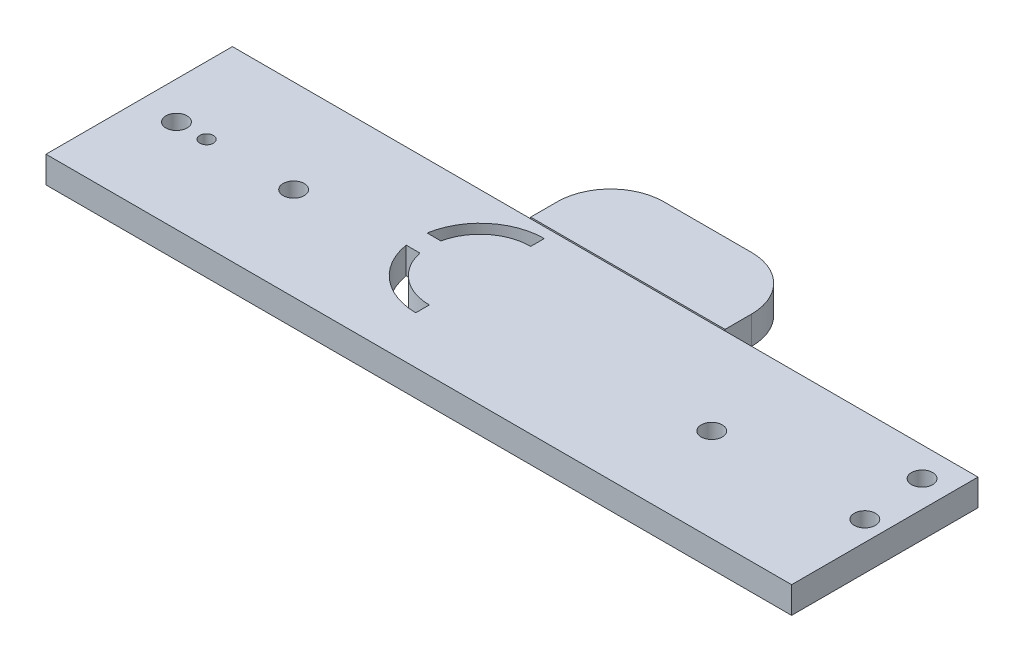
ISO-10303-21;
HEADER;
FILE_DESCRIPTION(('STEP AP214'),'2;1');
FILE_NAME('part.step','',(''),(''),'','','');
FILE_SCHEMA(('AUTOMOTIVE_DESIGN { 1 0 10303 214 1 1 1 1 }'));
ENDSEC;
DATA;
#1=APPLICATION_CONTEXT('core data for automotive mechanical design processes');
#2=APPLICATION_PROTOCOL_DEFINITION('international standard','automotive_design',2000,#1);
#3=PRODUCT_CONTEXT('',#1,'mechanical');
#4=PRODUCT('Part','Part','',(#3));
#5=PRODUCT_RELATED_PRODUCT_CATEGORY('part','',(#4));
#6=PRODUCT_DEFINITION_FORMATION('','',#4);
#7=PRODUCT_DEFINITION_CONTEXT('part definition',#1,'design');
#8=PRODUCT_DEFINITION('design','',#6,#7);
#9=PRODUCT_DEFINITION_SHAPE('','',#8);
#10=(LENGTH_UNIT() NAMED_UNIT(*) SI_UNIT(.MILLI.,.METRE.));
#11=(NAMED_UNIT(*) PLANE_ANGLE_UNIT() SI_UNIT($,.RADIAN.));
#12=(NAMED_UNIT(*) SI_UNIT($,.STERADIAN.) SOLID_ANGLE_UNIT());
#13=UNCERTAINTY_MEASURE_WITH_UNIT(LENGTH_MEASURE(1.E-05),#10,'distance_accuracy_value','');
#14=(GEOMETRIC_REPRESENTATION_CONTEXT(3) GLOBAL_UNCERTAINTY_ASSIGNED_CONTEXT((#13)) GLOBAL_UNIT_ASSIGNED_CONTEXT((#10,
#11,#12)) REPRESENTATION_CONTEXT('',''));
#15=CARTESIAN_POINT('',(0.,0.,0.));
#16=DIRECTION('',(0.,0.,1.));
#17=DIRECTION('',(1.,0.,0.));
#18=AXIS2_PLACEMENT_3D('',#15,#16,#17);
#19=CARTESIAN_POINT('',(0.,10.,0.));
#20=DIRECTION('',(0.,1.,0.));
#21=DIRECTION('',(0.,0.,1.));
#22=AXIS2_PLACEMENT_3D('',#19,#20,#21);
#23=PLANE('',#22);
#24=DIRECTION('',(1.,0.,0.));
#25=VECTOR('',#24,1.);
#26=CARTESIAN_POINT('',(0.,10.,0.));
#27=LINE('',#26,#25);
#28=CARTESIAN_POINT('',(0.,10.,0.));
#29=VERTEX_POINT('',#28);
#30=CARTESIAN_POINT('',(280.,10.,0.));
#31=VERTEX_POINT('',#30);
#32=EDGE_CURVE('E257',#29,#31,#27,.T.);
#33=ORIENTED_EDGE('',*,*,#32,.T.);
#34=DIRECTION('',(0.,0.,-1.));
#35=VECTOR('',#34,1.);
#36=CARTESIAN_POINT('',(280.,10.,0.));
#37=LINE('',#36,#35);
#38=CARTESIAN_POINT('',(280.,10.,-70.));
#39=VERTEX_POINT('',#38);
#40=EDGE_CURVE('E260',#31,#39,#37,.T.);
#41=ORIENTED_EDGE('',*,*,#40,.T.);
#42=DIRECTION('',(1.,0.,0.));
#43=VECTOR('',#42,1.);
#44=CARTESIAN_POINT('',(0.,10.,-70.));
#45=LINE('',#44,#43);
#46=CARTESIAN_POINT('',(185.,10.,-70.));
#47=VERTEX_POINT('',#46);
#48=EDGE_CURVE('E264',#47,#39,#45,.T.);
#49=ORIENTED_EDGE('',*,*,#48,.F.);
#50=CARTESIAN_POINT('',(112.,10.,-70.));
#51=VERTEX_POINT('',#50);
#52=EDGE_CURVE('E268',#51,#47,#45,.T.);
#53=ORIENTED_EDGE('',*,*,#52,.F.);
#54=CARTESIAN_POINT('',(0.,10.,-70.));
#55=VERTEX_POINT('',#54);
#56=EDGE_CURVE('E265',#55,#51,#45,.T.);
#57=ORIENTED_EDGE('',*,*,#56,.F.);
#58=DIRECTION('',(0.,0.,-1.));
#59=VECTOR('',#58,1.);
#60=CARTESIAN_POINT('',(0.,10.,0.));
#61=LINE('',#60,#59);
#62=EDGE_CURVE('E267',#29,#55,#61,.T.);
#63=ORIENTED_EDGE('',*,*,#62,.F.);
#64=EDGE_LOOP('',(#33,#41,#49,#53,#57,#63));
#65=FACE_BOUND('',#64,.T.);
#66=CARTESIAN_POINT('',(25.3189243971493,10.,-35.));
#67=DIRECTION('',(0.,1.,0.));
#68=DIRECTION('',(0.,0.,1.));
#69=AXIS2_PLACEMENT_3D('',#66,#67,#68);
#70=CIRCLE('',#69,2.54999999999999);
#71=CARTESIAN_POINT('',(25.3189243971493,10.,-32.45));
#72=VERTEX_POINT('',#71);
#73=EDGE_CURVE('E271',#72,#72,#70,.T.);
#74=ORIENTED_EDGE('',*,*,#73,.F.);
#75=EDGE_LOOP('',(#74));
#76=FACE_BOUND('',#75,.T.);
#77=CARTESIAN_POINT('',(14.,10.,-35.));
#78=DIRECTION('',(0.,1.,0.));
#79=DIRECTION('',(0.,0.,1.));
#80=AXIS2_PLACEMENT_3D('',#77,#78,#79);
#81=CIRCLE('',#80,3.96875);
#82=CARTESIAN_POINT('',(14.,10.,-31.03125));
#83=VERTEX_POINT('',#82);
#84=EDGE_CURVE('E274',#83,#83,#81,.T.);
#85=ORIENTED_EDGE('',*,*,#84,.F.);
#86=EDGE_LOOP('',(#85));
#87=FACE_BOUND('',#86,.T.);
#88=CARTESIAN_POINT('',(58.,10.,-35.));
#89=DIRECTION('',(0.,1.,0.));
#90=DIRECTION('',(0.,0.,1.));
#91=AXIS2_PLACEMENT_3D('',#88,#89,#90);
#92=CIRCLE('',#91,3.96875000000001);
#93=CARTESIAN_POINT('',(58.,10.,-31.03125));
#94=VERTEX_POINT('',#93);
#95=EDGE_CURVE('E277',#94,#94,#92,.T.);
#96=ORIENTED_EDGE('',*,*,#95,.F.);
#97=EDGE_LOOP('',(#96));
#98=FACE_BOUND('',#97,.T.);
#99=CARTESIAN_POINT('',(272.5,10.,-35.));
#100=DIRECTION('',(0.,1.,0.));
#101=DIRECTION('',(0.,0.,1.));
#102=AXIS2_PLACEMENT_3D('',#99,#100,#101);
#103=CIRCLE('',#102,3.96874999999999);
#104=CARTESIAN_POINT('',(272.5,10.,-31.03125));
#105=VERTEX_POINT('',#104);
#106=EDGE_CURVE('E280',#105,#105,#103,.T.);
#107=ORIENTED_EDGE('',*,*,#106,.F.);
#108=EDGE_LOOP('',(#107));
#109=FACE_BOUND('',#108,.T.);
#110=CARTESIAN_POINT('',(270.,10.,-59.));
#111=DIRECTION('',(0.,1.,0.));
#112=DIRECTION('',(0.,0.,1.));
#113=AXIS2_PLACEMENT_3D('',#110,#111,#112);
#114=CIRCLE('',#113,3.96875000000005);
#115=CARTESIAN_POINT('',(270.,10.,-55.03125));
#116=VERTEX_POINT('',#115);
#117=EDGE_CURVE('E283',#116,#116,#114,.T.);
#118=ORIENTED_EDGE('',*,*,#117,.F.);
#119=EDGE_LOOP('',(#118));
#120=FACE_BOUND('',#119,.T.);
#121=CARTESIAN_POINT('',(215.,10.,-35.));
#122=DIRECTION('',(0.,1.,0.));
#123=DIRECTION('',(0.,0.,1.));
#124=AXIS2_PLACEMENT_3D('',#121,#122,#123);
#125=CIRCLE('',#124,3.96874999999999);
#126=CARTESIAN_POINT('',(215.,10.,-31.03125));
#127=VERTEX_POINT('',#126);
#128=EDGE_CURVE('E286',#127,#127,#125,.T.);
#129=ORIENTED_EDGE('',*,*,#128,.F.);
#130=EDGE_LOOP('',(#129));
#131=FACE_BOUND('',#130,.T.);
#132=DIRECTION('',(0.,0.,1.));
#133=VECTOR('',#132,1.);
#134=CARTESIAN_POINT('',(121.,10.,0.));
#135=LINE('',#134,#133);
#136=CARTESIAN_POINT('',(121.,10.,-66.13));
#137=VERTEX_POINT('',#136);
#138=CARTESIAN_POINT('',(121.,10.,-61.05));
#139=VERTEX_POINT('',#138);
#140=EDGE_CURVE('E216',#137,#139,#135,.T.);
#141=ORIENTED_EDGE('',*,*,#140,.T.);
#142=CARTESIAN_POINT('',(121.,10.,-42.));
#143=DIRECTION('',(0.,1.,0.));
#144=DIRECTION('',(0.,0.,1.));
#145=AXIS2_PLACEMENT_3D('',#142,#143,#144);
#146=CIRCLE('',#145,19.05);
#147=CARTESIAN_POINT('',(102.361874001344,10.,-45.9398933054387));
#148=VERTEX_POINT('',#147);
#149=EDGE_CURVE('E198',#139,#148,#146,.T.);
#150=ORIENTED_EDGE('',*,*,#149,.T.);
#151=DIRECTION('',(1.,0.,0.));
#152=VECTOR('',#151,1.);
#153=CARTESIAN_POINT('',(0.,10.,-45.9398933054387));
#154=LINE('',#153,#152);
#155=CARTESIAN_POINT('',(97.1938213746566,10.,-45.9398933054387));
#156=VERTEX_POINT('',#155);
#157=EDGE_CURVE('E205',#156,#148,#154,.T.);
#158=ORIENTED_EDGE('',*,*,#157,.F.);
#159=CARTESIAN_POINT('',(121.,10.,-42.));
#160=DIRECTION('',(0.,1.,0.));
#161=DIRECTION('',(0.,0.,1.));
#162=AXIS2_PLACEMENT_3D('',#159,#160,#161);
#163=CIRCLE('',#162,24.13);
#164=EDGE_CURVE('E219',#137,#156,#163,.T.);
#165=ORIENTED_EDGE('',*,*,#164,.F.);
#166=EDGE_LOOP('',(#141,#150,#158,#165));
#167=FACE_BOUND('',#166,.T.);
#168=DIRECTION('',(1.,0.,0.));
#169=VECTOR('',#168,1.);
#170=CARTESIAN_POINT('',(0.,10.,-38.0601066945613));
#171=LINE('',#170,#169);
#172=CARTESIAN_POINT('',(97.1938213746566,10.,-38.0601066945614));
#173=VERTEX_POINT('',#172);
#174=CARTESIAN_POINT('',(102.361874001344,10.,-38.0601066945614));
#175=VERTEX_POINT('',#174);
#176=EDGE_CURVE('E192',#173,#175,#171,.T.);
#177=ORIENTED_EDGE('',*,*,#176,.T.);
#178=CARTESIAN_POINT('',(121.,10.,-42.));
#179=DIRECTION('',(0.,1.,0.));
#180=DIRECTION('',(0.,0.,1.));
#181=AXIS2_PLACEMENT_3D('',#178,#179,#180);
#182=CIRCLE('',#181,19.05);
#183=CARTESIAN_POINT('',(121.,10.,-22.95));
#184=VERTEX_POINT('',#183);
#185=EDGE_CURVE('E50',#175,#184,#182,.T.);
#186=ORIENTED_EDGE('',*,*,#185,.T.);
#187=DIRECTION('',(0.,0.,1.));
#188=VECTOR('',#187,1.);
#189=CARTESIAN_POINT('',(121.,10.,0.));
#190=LINE('',#189,#188);
#191=CARTESIAN_POINT('',(121.,10.,-17.87));
#192=VERTEX_POINT('',#191);
#193=EDGE_CURVE('E183',#184,#192,#190,.T.);
#194=ORIENTED_EDGE('',*,*,#193,.T.);
#195=CARTESIAN_POINT('',(121.,10.,-42.));
#196=DIRECTION('',(0.,1.,0.));
#197=DIRECTION('',(0.,0.,1.));
#198=AXIS2_PLACEMENT_3D('',#195,#196,#197);
#199=CIRCLE('',#198,24.13);
#200=EDGE_CURVE('E186',#173,#192,#199,.T.);
#201=ORIENTED_EDGE('',*,*,#200,.F.);
#202=EDGE_LOOP('',(#177,#186,#194,#201));
#203=FACE_BOUND('',#202,.T.);
#204=ADVANCED_FACE('F35',(#65,#76,#87,#98,#109,#120,#131,#167,#203),#23,.T.);
#205=CARTESIAN_POINT('',(0.,0.,0.));
#206=DIRECTION('',(0.,1.,0.));
#207=DIRECTION('',(0.,0.,1.));
#208=AXIS2_PLACEMENT_3D('',#205,#206,#207);
#209=PLANE('',#208);
#210=CARTESIAN_POINT('',(121.,0.,-42.));
#211=DIRECTION('',(0.,1.,0.));
#212=DIRECTION('',(0.,0.,1.));
#213=AXIS2_PLACEMENT_3D('',#210,#211,#212);
#214=CIRCLE('',#213,19.05);
#215=CARTESIAN_POINT('',(121.,0.,-61.05));
#216=VERTEX_POINT('',#215);
#217=CARTESIAN_POINT('',(102.361874001344,0.,-45.9398933054387));
#218=VERTEX_POINT('',#217);
#219=EDGE_CURVE('E202',#216,#218,#214,.T.);
#220=ORIENTED_EDGE('',*,*,#219,.F.);
#221=DIRECTION('',(0.,0.,1.));
#222=VECTOR('',#221,1.);
#223=CARTESIAN_POINT('',(121.,0.,0.));
#224=LINE('',#223,#222);
#225=CARTESIAN_POINT('',(121.,0.,-66.13));
#226=VERTEX_POINT('',#225);
#227=EDGE_CURVE('E204',#226,#216,#224,.T.);
#228=ORIENTED_EDGE('',*,*,#227,.F.);
#229=CARTESIAN_POINT('',(121.,0.,-42.));
#230=DIRECTION('',(0.,1.,0.));
#231=DIRECTION('',(0.,0.,1.));
#232=AXIS2_PLACEMENT_3D('',#229,#230,#231);
#233=CIRCLE('',#232,24.13);
#234=CARTESIAN_POINT('',(97.1938213746566,0.,-45.9398933054387));
#235=VERTEX_POINT('',#234);
#236=EDGE_CURVE('E207',#226,#235,#233,.T.);
#237=ORIENTED_EDGE('',*,*,#236,.T.);
#238=DIRECTION('',(1.,0.,0.));
#239=VECTOR('',#238,1.);
#240=CARTESIAN_POINT('',(0.,0.,-45.9398933054387));
#241=LINE('',#240,#239);
#242=EDGE_CURVE('E210',#235,#218,#241,.T.);
#243=ORIENTED_EDGE('',*,*,#242,.T.);
#244=EDGE_LOOP('',(#220,#228,#237,#243));
#245=FACE_BOUND('',#244,.T.);
#246=DIRECTION('',(0.,0.,1.));
#247=VECTOR('',#246,1.);
#248=CARTESIAN_POINT('',(112.,0.,-100.));
#249=LINE('',#248,#247);
#250=CARTESIAN_POINT('',(112.,0.,-80.));
#251=VERTEX_POINT('',#250);
#252=CARTESIAN_POINT('',(112.,0.,-70.));
#253=VERTEX_POINT('',#252);
#254=EDGE_CURVE('E252',#251,#253,#249,.T.);
#255=ORIENTED_EDGE('',*,*,#254,.F.);
#256=CARTESIAN_POINT('',(132.,0.,-80.));
#257=DIRECTION('',(0.,1.,0.));
#258=DIRECTION('',(0.,0.,1.));
#259=AXIS2_PLACEMENT_3D('',#256,#257,#258);
#260=CIRCLE('',#259,20.);
#261=CARTESIAN_POINT('',(132.,0.,-100.));
#262=VERTEX_POINT('',#261);
#263=EDGE_CURVE('E11',#251,#262,#260,.F.);
#264=ORIENTED_EDGE('',*,*,#263,.T.);
#265=DIRECTION('',(-1.,0.,0.));
#266=VECTOR('',#265,1.);
#267=CARTESIAN_POINT('',(185.,0.,-100.));
#268=LINE('',#267,#266);
#269=CARTESIAN_POINT('',(165.,0.,-100.));
#270=VERTEX_POINT('',#269);
#271=EDGE_CURVE('E233',#270,#262,#268,.T.);
#272=ORIENTED_EDGE('',*,*,#271,.F.);
#273=CARTESIAN_POINT('',(165.,0.,-80.));
#274=DIRECTION('',(0.,1.,0.));
#275=DIRECTION('',(0.,0.,1.));
#276=AXIS2_PLACEMENT_3D('',#273,#274,#275);
#277=CIRCLE('',#276,20.);
#278=CARTESIAN_POINT('',(185.,0.,-80.));
#279=VERTEX_POINT('',#278);
#280=EDGE_CURVE('E331',#270,#279,#277,.F.);
#281=ORIENTED_EDGE('',*,*,#280,.T.);
#282=DIRECTION('',(0.,0.,1.));
#283=VECTOR('',#282,1.);
#284=CARTESIAN_POINT('',(185.,0.,-100.));
#285=LINE('',#284,#283);
#286=CARTESIAN_POINT('',(185.,0.,-70.));
#287=VERTEX_POINT('',#286);
#288=EDGE_CURVE('E254',#279,#287,#285,.T.);
#289=ORIENTED_EDGE('',*,*,#288,.T.);
#290=DIRECTION('',(1.,0.,0.));
#291=VECTOR('',#290,1.);
#292=CARTESIAN_POINT('',(0.,0.,-70.));
#293=LINE('',#292,#291);
#294=CARTESIAN_POINT('',(280.,0.,-70.));
#295=VERTEX_POINT('',#294);
#296=EDGE_CURVE('E295',#287,#295,#293,.T.);
#297=ORIENTED_EDGE('',*,*,#296,.T.);
#298=DIRECTION('',(0.,0.,-1.));
#299=VECTOR('',#298,1.);
#300=CARTESIAN_POINT('',(280.,0.,0.));
#301=LINE('',#300,#299);
#302=CARTESIAN_POINT('',(280.,0.,0.));
#303=VERTEX_POINT('',#302);
#304=EDGE_CURVE('E292',#303,#295,#301,.T.);
#305=ORIENTED_EDGE('',*,*,#304,.F.);
#306=DIRECTION('',(1.,0.,0.));
#307=VECTOR('',#306,1.);
#308=CARTESIAN_POINT('',(0.,0.,0.));
#309=LINE('',#308,#307);
#310=CARTESIAN_POINT('',(0.,0.,0.));
#311=VERTEX_POINT('',#310);
#312=EDGE_CURVE('E256',#311,#303,#309,.T.);
#313=ORIENTED_EDGE('',*,*,#312,.F.);
#314=DIRECTION('',(0.,0.,-1.));
#315=VECTOR('',#314,1.);
#316=CARTESIAN_POINT('',(0.,0.,0.));
#317=LINE('',#316,#315);
#318=CARTESIAN_POINT('',(0.,0.,-70.));
#319=VERTEX_POINT('',#318);
#320=EDGE_CURVE('E299',#311,#319,#317,.T.);
#321=ORIENTED_EDGE('',*,*,#320,.T.);
#322=EDGE_CURVE('E296',#319,#253,#293,.T.);
#323=ORIENTED_EDGE('',*,*,#322,.T.);
#324=EDGE_LOOP('',(#255,#264,#272,#281,#289,#297,#305,#313,#321,#323));
#325=FACE_BOUND('',#324,.T.);
#326=CARTESIAN_POINT('',(25.3189243971493,0.,-35.));
#327=DIRECTION('',(0.,1.,0.));
#328=DIRECTION('',(0.,0.,1.));
#329=AXIS2_PLACEMENT_3D('',#326,#327,#328);
#330=CIRCLE('',#329,2.54999999999999);
#331=CARTESIAN_POINT('',(25.3189243971493,0.,-32.45));
#332=VERTEX_POINT('',#331);
#333=EDGE_CURVE('E302',#332,#332,#330,.T.);
#334=ORIENTED_EDGE('',*,*,#333,.T.);
#335=EDGE_LOOP('',(#334));
#336=FACE_BOUND('',#335,.T.);
#337=CARTESIAN_POINT('',(14.,0.,-35.));
#338=DIRECTION('',(0.,1.,0.));
#339=DIRECTION('',(0.,0.,1.));
#340=AXIS2_PLACEMENT_3D('',#337,#338,#339);
#341=CIRCLE('',#340,3.96875);
#342=CARTESIAN_POINT('',(14.,0.,-31.03125));
#343=VERTEX_POINT('',#342);
#344=EDGE_CURVE('E305',#343,#343,#341,.T.);
#345=ORIENTED_EDGE('',*,*,#344,.T.);
#346=EDGE_LOOP('',(#345));
#347=FACE_BOUND('',#346,.T.);
#348=CARTESIAN_POINT('',(58.,0.,-35.));
#349=DIRECTION('',(0.,1.,0.));
#350=DIRECTION('',(0.,0.,1.));
#351=AXIS2_PLACEMENT_3D('',#348,#349,#350);
#352=CIRCLE('',#351,3.96875000000001);
#353=CARTESIAN_POINT('',(58.,0.,-31.03125));
#354=VERTEX_POINT('',#353);
#355=EDGE_CURVE('E308',#354,#354,#352,.T.);
#356=ORIENTED_EDGE('',*,*,#355,.T.);
#357=EDGE_LOOP('',(#356));
#358=FACE_BOUND('',#357,.T.);
#359=CARTESIAN_POINT('',(272.5,0.,-35.));
#360=DIRECTION('',(0.,1.,0.));
#361=DIRECTION('',(0.,0.,1.));
#362=AXIS2_PLACEMENT_3D('',#359,#360,#361);
#363=CIRCLE('',#362,3.96874999999999);
#364=CARTESIAN_POINT('',(272.5,0.,-31.03125));
#365=VERTEX_POINT('',#364);
#366=EDGE_CURVE('E311',#365,#365,#363,.T.);
#367=ORIENTED_EDGE('',*,*,#366,.T.);
#368=EDGE_LOOP('',(#367));
#369=FACE_BOUND('',#368,.T.);
#370=CARTESIAN_POINT('',(270.,0.,-59.));
#371=DIRECTION('',(0.,1.,0.));
#372=DIRECTION('',(0.,0.,1.));
#373=AXIS2_PLACEMENT_3D('',#370,#371,#372);
#374=CIRCLE('',#373,3.96875000000005);
#375=CARTESIAN_POINT('',(270.,0.,-55.03125));
#376=VERTEX_POINT('',#375);
#377=EDGE_CURVE('E314',#376,#376,#374,.T.);
#378=ORIENTED_EDGE('',*,*,#377,.T.);
#379=EDGE_LOOP('',(#378));
#380=FACE_BOUND('',#379,.T.);
#381=CARTESIAN_POINT('',(215.,0.,-35.));
#382=DIRECTION('',(0.,1.,0.));
#383=DIRECTION('',(0.,0.,1.));
#384=AXIS2_PLACEMENT_3D('',#381,#382,#383);
#385=CIRCLE('',#384,3.96874999999999);
#386=CARTESIAN_POINT('',(215.,0.,-31.03125));
#387=VERTEX_POINT('',#386);
#388=EDGE_CURVE('E261',#387,#387,#385,.T.);
#389=ORIENTED_EDGE('',*,*,#388,.T.);
#390=EDGE_LOOP('',(#389));
#391=FACE_BOUND('',#390,.T.);
#392=CARTESIAN_POINT('',(121.,0.,-42.));
#393=DIRECTION('',(0.,1.,0.));
#394=DIRECTION('',(0.,0.,1.));
#395=AXIS2_PLACEMENT_3D('',#392,#393,#394);
#396=CIRCLE('',#395,19.05);
#397=CARTESIAN_POINT('',(102.361874001344,0.,-38.0601066945614));
#398=VERTEX_POINT('',#397);
#399=CARTESIAN_POINT('',(121.,0.,-22.95));
#400=VERTEX_POINT('',#399);
#401=EDGE_CURVE('E175',#398,#400,#396,.T.);
#402=ORIENTED_EDGE('',*,*,#401,.F.);
#403=DIRECTION('',(1.,0.,0.));
#404=VECTOR('',#403,1.);
#405=CARTESIAN_POINT('',(0.,0.,-38.0601066945613));
#406=LINE('',#405,#404);
#407=CARTESIAN_POINT('',(97.1938213746566,0.,-38.0601066945614));
#408=VERTEX_POINT('',#407);
#409=EDGE_CURVE('E167',#408,#398,#406,.T.);
#410=ORIENTED_EDGE('',*,*,#409,.F.);
#411=CARTESIAN_POINT('',(121.,0.,-42.));
#412=DIRECTION('',(0.,1.,0.));
#413=DIRECTION('',(0.,0.,1.));
#414=AXIS2_PLACEMENT_3D('',#411,#412,#413);
#415=CIRCLE('',#414,24.13);
#416=CARTESIAN_POINT('',(121.,0.,-17.87));
#417=VERTEX_POINT('',#416);
#418=EDGE_CURVE('E58',#408,#417,#415,.T.);
#419=ORIENTED_EDGE('',*,*,#418,.T.);
#420=DIRECTION('',(0.,0.,1.));
#421=VECTOR('',#420,1.);
#422=CARTESIAN_POINT('',(121.,0.,0.));
#423=LINE('',#422,#421);
#424=EDGE_CURVE('E179',#400,#417,#423,.T.);
#425=ORIENTED_EDGE('',*,*,#424,.F.);
#426=EDGE_LOOP('',(#402,#410,#419,#425));
#427=FACE_BOUND('',#426,.T.);
#428=ADVANCED_FACE('F182',(#245,#325,#336,#347,#358,#369,#380,#391,#427),#209,.F.);
#429=CARTESIAN_POINT('',(0.,10.,-70.));
#430=DIRECTION('',(0.,0.,-1.));
#431=DIRECTION('',(-1.,0.,0.));
#432=AXIS2_PLACEMENT_3D('',#429,#430,#431);
#433=PLANE('',#432);
#434=DIRECTION('',(0.,-1.,0.));
#435=VECTOR('',#434,1.);
#436=CARTESIAN_POINT('',(185.,10.5383214670061,-70.));
#437=LINE('',#436,#435);
#438=EDGE_CURVE('E243',#47,#287,#437,.T.);
#439=ORIENTED_EDGE('',*,*,#438,.F.);
#440=ORIENTED_EDGE('',*,*,#48,.T.);
#441=DIRECTION('',(0.,-1.,0.));
#442=VECTOR('',#441,1.);
#443=CARTESIAN_POINT('',(280.,10.,-70.));
#444=LINE('',#443,#442);
#445=EDGE_CURVE('E322',#39,#295,#444,.T.);
#446=ORIENTED_EDGE('',*,*,#445,.T.);
#447=ORIENTED_EDGE('',*,*,#296,.F.);
#448=EDGE_LOOP('',(#439,#440,#446,#447));
#449=FACE_BOUND('',#448,.T.);
#450=ADVANCED_FACE('F375',(#449),#433,.T.);
#451=CARTESIAN_POINT('',(0.,10.,0.));
#452=DIRECTION('',(0.,0.,-1.));
#453=DIRECTION('',(-1.,0.,0.));
#454=AXIS2_PLACEMENT_3D('',#451,#452,#453);
#455=PLANE('',#454);
#456=ORIENTED_EDGE('',*,*,#312,.T.);
#457=DIRECTION('',(0.,-1.,0.));
#458=VECTOR('',#457,1.);
#459=CARTESIAN_POINT('',(280.,10.,0.));
#460=LINE('',#459,#458);
#461=EDGE_CURVE('E325',#31,#303,#460,.T.);
#462=ORIENTED_EDGE('',*,*,#461,.F.);
#463=ORIENTED_EDGE('',*,*,#32,.F.);
#464=DIRECTION('',(0.,-1.,0.));
#465=VECTOR('',#464,1.);
#466=CARTESIAN_POINT('',(0.,10.,0.));
#467=LINE('',#466,#465);
#468=EDGE_CURVE('E289',#29,#311,#467,.T.);
#469=ORIENTED_EDGE('',*,*,#468,.T.);
#470=EDGE_LOOP('',(#456,#462,#463,#469));
#471=FACE_BOUND('',#470,.T.);
#472=ADVANCED_FACE('F396',(#471),#455,.F.);
#473=CARTESIAN_POINT('',(280.,10.,0.));
#474=DIRECTION('',(-1.,0.,0.));
#475=DIRECTION('',(0.,0.,1.));
#476=AXIS2_PLACEMENT_3D('',#473,#474,#475);
#477=PLANE('',#476);
#478=ORIENTED_EDGE('',*,*,#304,.T.);
#479=ORIENTED_EDGE('',*,*,#445,.F.);
#480=ORIENTED_EDGE('',*,*,#40,.F.);
#481=ORIENTED_EDGE('',*,*,#461,.T.);
#482=EDGE_LOOP('',(#478,#479,#480,#481));
#483=FACE_BOUND('',#482,.T.);
#484=ADVANCED_FACE('F398',(#483),#477,.F.);
#485=DIRECTION('',(0.,1.,0.));
#486=VECTOR('',#485,1.);
#487=CARTESIAN_POINT('',(112.,10.5383214670061,-70.));
#488=LINE('',#487,#486);
#489=EDGE_CURVE('E244',#253,#51,#488,.T.);
#490=ORIENTED_EDGE('',*,*,#489,.F.);
#491=ORIENTED_EDGE('',*,*,#322,.F.);
#492=DIRECTION('',(0.,-1.,0.));
#493=VECTOR('',#492,1.);
#494=CARTESIAN_POINT('',(0.,10.,-70.));
#495=LINE('',#494,#493);
#496=EDGE_CURVE('E320',#55,#319,#495,.T.);
#497=ORIENTED_EDGE('',*,*,#496,.F.);
#498=ORIENTED_EDGE('',*,*,#56,.T.);
#499=EDGE_LOOP('',(#490,#491,#497,#498));
#500=FACE_BOUND('',#499,.T.);
#501=ADVANCED_FACE('F387',(#500),#433,.T.);
#502=CARTESIAN_POINT('',(270.,10.,-59.));
#503=DIRECTION('',(0.,-1.,0.));
#504=DIRECTION('',(0.,0.,-1.));
#505=AXIS2_PLACEMENT_3D('',#502,#503,#504);
#506=CYLINDRICAL_SURFACE('',#505,3.96875000000005);
#507=ORIENTED_EDGE('',*,*,#117,.T.);
#508=EDGE_LOOP('',(#507));
#509=FACE_BOUND('',#508,.T.);
#510=ORIENTED_EDGE('',*,*,#377,.F.);
#511=EDGE_LOOP('',(#510));
#512=FACE_BOUND('',#511,.T.);
#513=ADVANCED_FACE('F405',(#509,#512),#506,.F.);
#514=CARTESIAN_POINT('',(272.5,10.,-35.));
#515=DIRECTION('',(0.,-1.,0.));
#516=DIRECTION('',(0.,0.,-1.));
#517=AXIS2_PLACEMENT_3D('',#514,#515,#516);
#518=CYLINDRICAL_SURFACE('',#517,3.96874999999999);
#519=ORIENTED_EDGE('',*,*,#106,.T.);
#520=EDGE_LOOP('',(#519));
#521=FACE_BOUND('',#520,.T.);
#522=ORIENTED_EDGE('',*,*,#366,.F.);
#523=EDGE_LOOP('',(#522));
#524=FACE_BOUND('',#523,.T.);
#525=ADVANCED_FACE('F424',(#521,#524),#518,.F.);
#526=CARTESIAN_POINT('',(58.,10.,-35.));
#527=DIRECTION('',(0.,-1.,0.));
#528=DIRECTION('',(0.,0.,-1.));
#529=AXIS2_PLACEMENT_3D('',#526,#527,#528);
#530=CYLINDRICAL_SURFACE('',#529,3.96875000000001);
#531=ORIENTED_EDGE('',*,*,#95,.T.);
#532=EDGE_LOOP('',(#531));
#533=FACE_BOUND('',#532,.T.);
#534=ORIENTED_EDGE('',*,*,#355,.F.);
#535=EDGE_LOOP('',(#534));
#536=FACE_BOUND('',#535,.T.);
#537=ADVANCED_FACE('F428',(#533,#536),#530,.F.);
#538=CARTESIAN_POINT('',(14.,10.,-35.));
#539=DIRECTION('',(0.,-1.,0.));
#540=DIRECTION('',(0.,0.,-1.));
#541=AXIS2_PLACEMENT_3D('',#538,#539,#540);
#542=CYLINDRICAL_SURFACE('',#541,3.96875);
#543=ORIENTED_EDGE('',*,*,#84,.T.);
#544=EDGE_LOOP('',(#543));
#545=FACE_BOUND('',#544,.T.);
#546=ORIENTED_EDGE('',*,*,#344,.F.);
#547=EDGE_LOOP('',(#546));
#548=FACE_BOUND('',#547,.T.);
#549=ADVANCED_FACE('F432',(#545,#548),#542,.F.);
#550=CARTESIAN_POINT('',(25.3189243971493,10.,-35.));
#551=DIRECTION('',(0.,-1.,0.));
#552=DIRECTION('',(0.,0.,-1.));
#553=AXIS2_PLACEMENT_3D('',#550,#551,#552);
#554=CYLINDRICAL_SURFACE('',#553,2.54999999999999);
#555=ORIENTED_EDGE('',*,*,#73,.T.);
#556=EDGE_LOOP('',(#555));
#557=FACE_BOUND('',#556,.T.);
#558=ORIENTED_EDGE('',*,*,#333,.F.);
#559=EDGE_LOOP('',(#558));
#560=FACE_BOUND('',#559,.T.);
#561=ADVANCED_FACE('F436',(#557,#560),#554,.F.);
#562=CARTESIAN_POINT('',(0.,10.,0.));
#563=DIRECTION('',(-1.,0.,0.));
#564=DIRECTION('',(0.,0.,1.));
#565=AXIS2_PLACEMENT_3D('',#562,#563,#564);
#566=PLANE('',#565);
#567=ORIENTED_EDGE('',*,*,#320,.F.);
#568=ORIENTED_EDGE('',*,*,#468,.F.);
#569=ORIENTED_EDGE('',*,*,#62,.T.);
#570=ORIENTED_EDGE('',*,*,#496,.T.);
#571=EDGE_LOOP('',(#567,#568,#569,#570));
#572=FACE_BOUND('',#571,.T.);
#573=ADVANCED_FACE('F391',(#572),#566,.T.);
#574=CARTESIAN_POINT('',(215.,10.,-35.));
#575=DIRECTION('',(0.,-1.,0.));
#576=DIRECTION('',(0.,0.,-1.));
#577=AXIS2_PLACEMENT_3D('',#574,#575,#576);
#578=CYLINDRICAL_SURFACE('',#577,3.96874999999999);
#579=ORIENTED_EDGE('',*,*,#128,.T.);
#580=EDGE_LOOP('',(#579));
#581=FACE_BOUND('',#580,.T.);
#582=ORIENTED_EDGE('',*,*,#388,.F.);
#583=EDGE_LOOP('',(#582));
#584=FACE_BOUND('',#583,.T.);
#585=ADVANCED_FACE('F418',(#581,#584),#578,.F.);
#586=CARTESIAN_POINT('',(0.,0.,-70.));
#587=DIRECTION('',(0.,0.,-1.));
#588=DIRECTION('',(-1.,0.,0.));
#589=AXIS2_PLACEMENT_3D('',#586,#587,#588);
#590=PLANE('',#589);
#591=CARTESIAN_POINT('',(112.,10.5383214670061,-70.));
#592=VERTEX_POINT('',#591);
#593=EDGE_CURVE('E242',#51,#592,#488,.T.);
#594=ORIENTED_EDGE('',*,*,#593,.F.);
#595=ORIENTED_EDGE('',*,*,#52,.T.);
#596=CARTESIAN_POINT('',(185.,10.5383214670061,-70.));
#597=VERTEX_POINT('',#596);
#598=EDGE_CURVE('E226',#597,#47,#437,.T.);
#599=ORIENTED_EDGE('',*,*,#598,.F.);
#600=DIRECTION('',(1.,0.,0.));
#601=VECTOR('',#600,1.);
#602=CARTESIAN_POINT('',(185.,10.5383214670061,-70.));
#603=LINE('',#602,#601);
#604=EDGE_CURVE('E237',#592,#597,#603,.T.);
#605=ORIENTED_EDGE('',*,*,#604,.F.);
#606=EDGE_LOOP('',(#594,#595,#599,#605));
#607=FACE_BOUND('',#606,.T.);
#608=ADVANCED_FACE('F384',(#607),#590,.F.);
#609=CARTESIAN_POINT('',(185.,10.5383214670061,-100.));
#610=DIRECTION('',(-1.,0.,0.));
#611=DIRECTION('',(0.,-1.,0.));
#612=AXIS2_PLACEMENT_3D('',#609,#610,#611);
#613=PLANE('',#612);
#614=ORIENTED_EDGE('',*,*,#288,.F.);
#615=DIRECTION('',(0.,-1.,0.));
#616=VECTOR('',#615,1.);
#617=CARTESIAN_POINT('',(185.,10.5383214670061,-80.));
#618=LINE('',#617,#616);
#619=CARTESIAN_POINT('',(185.,10.5383214670061,-80.));
#620=VERTEX_POINT('',#619);
#621=EDGE_CURVE('E333',#279,#620,#618,.F.);
#622=ORIENTED_EDGE('',*,*,#621,.T.);
#623=DIRECTION('',(0.,0.,1.));
#624=VECTOR('',#623,1.);
#625=CARTESIAN_POINT('',(185.,10.5383214670061,-100.));
#626=LINE('',#625,#624);
#627=EDGE_CURVE('E239',#620,#597,#626,.T.);
#628=ORIENTED_EDGE('',*,*,#627,.T.);
#629=ORIENTED_EDGE('',*,*,#598,.T.);
#630=ORIENTED_EDGE('',*,*,#438,.T.);
#631=EDGE_LOOP('',(#614,#622,#628,#629,#630));
#632=FACE_BOUND('',#631,.T.);
#633=ADVANCED_FACE('F371',(#632),#613,.F.);
#634=CARTESIAN_POINT('',(112.,10.5383214670061,-100.));
#635=DIRECTION('',(1.,0.,0.));
#636=DIRECTION('',(0.,0.,-1.));
#637=AXIS2_PLACEMENT_3D('',#634,#635,#636);
#638=PLANE('',#637);
#639=DIRECTION('',(0.,0.,1.));
#640=VECTOR('',#639,1.);
#641=CARTESIAN_POINT('',(112.,10.5383214670061,-100.));
#642=LINE('',#641,#640);
#643=CARTESIAN_POINT('',(112.,10.5383214670061,-80.));
#644=VERTEX_POINT('',#643);
#645=EDGE_CURVE('E250',#644,#592,#642,.T.);
#646=ORIENTED_EDGE('',*,*,#645,.F.);
#647=DIRECTION('',(0.,1.,0.));
#648=VECTOR('',#647,1.);
#649=CARTESIAN_POINT('',(112.,0.,-80.));
#650=LINE('',#649,#648);
#651=EDGE_CURVE('E43',#644,#251,#650,.F.);
#652=ORIENTED_EDGE('',*,*,#651,.T.);
#653=ORIENTED_EDGE('',*,*,#254,.T.);
#654=ORIENTED_EDGE('',*,*,#489,.T.);
#655=ORIENTED_EDGE('',*,*,#593,.T.);
#656=EDGE_LOOP('',(#646,#652,#653,#654,#655));
#657=FACE_BOUND('',#656,.T.);
#658=ADVANCED_FACE('F346',(#657),#638,.F.);
#659=CARTESIAN_POINT('',(185.,10.5383214670061,-100.));
#660=DIRECTION('',(0.,-1.,0.));
#661=DIRECTION('',(0.,0.,-1.));
#662=AXIS2_PLACEMENT_3D('',#659,#660,#661);
#663=PLANE('',#662);
#664=DIRECTION('',(1.,0.,0.));
#665=VECTOR('',#664,1.);
#666=CARTESIAN_POINT('',(185.,10.5383214670061,-100.));
#667=LINE('',#666,#665);
#668=CARTESIAN_POINT('',(132.,10.5383214670061,-100.));
#669=VERTEX_POINT('',#668);
#670=CARTESIAN_POINT('',(165.,10.5383214670061,-100.));
#671=VERTEX_POINT('',#670);
#672=EDGE_CURVE('E236',#669,#671,#667,.T.);
#673=ORIENTED_EDGE('',*,*,#672,.F.);
#674=CARTESIAN_POINT('',(132.,10.5383214670061,-80.));
#675=DIRECTION('',(0.,-1.,0.));
#676=DIRECTION('',(0.,0.,-1.));
#677=AXIS2_PLACEMENT_3D('',#674,#675,#676);
#678=CIRCLE('',#677,20.);
#679=EDGE_CURVE('E341',#669,#644,#678,.F.);
#680=ORIENTED_EDGE('',*,*,#679,.T.);
#681=ORIENTED_EDGE('',*,*,#645,.T.);
#682=ORIENTED_EDGE('',*,*,#604,.T.);
#683=ORIENTED_EDGE('',*,*,#627,.F.);
#684=CARTESIAN_POINT('',(165.,10.5383214670061,-80.));
#685=DIRECTION('',(0.,-1.,0.));
#686=DIRECTION('',(0.,0.,-1.));
#687=AXIS2_PLACEMENT_3D('',#684,#685,#686);
#688=CIRCLE('',#687,20.);
#689=EDGE_CURVE('E335',#620,#671,#688,.F.);
#690=ORIENTED_EDGE('',*,*,#689,.T.);
#691=EDGE_LOOP('',(#673,#680,#681,#682,#683,#690));
#692=FACE_BOUND('',#691,.T.);
#693=ADVANCED_FACE('F360',(#692),#663,.F.);
#694=CARTESIAN_POINT('',(0.,0.,-100.));
#695=DIRECTION('',(0.,0.,-1.));
#696=DIRECTION('',(-1.,0.,0.));
#697=AXIS2_PLACEMENT_3D('',#694,#695,#696);
#698=PLANE('',#697);
#699=ORIENTED_EDGE('',*,*,#271,.T.);
#700=DIRECTION('',(0.,1.,0.));
#701=VECTOR('',#700,1.);
#702=CARTESIAN_POINT('',(132.,10.5383214670061,-100.));
#703=LINE('',#702,#701);
#704=EDGE_CURVE('E338',#262,#669,#703,.T.);
#705=ORIENTED_EDGE('',*,*,#704,.T.);
#706=ORIENTED_EDGE('',*,*,#672,.T.);
#707=DIRECTION('',(0.,-1.,0.));
#708=VECTOR('',#707,1.);
#709=CARTESIAN_POINT('',(165.,0.,-100.));
#710=LINE('',#709,#708);
#711=EDGE_CURVE('E328',#671,#270,#710,.T.);
#712=ORIENTED_EDGE('',*,*,#711,.T.);
#713=EDGE_LOOP('',(#699,#705,#706,#712));
#714=FACE_BOUND('',#713,.T.);
#715=ADVANCED_FACE('F358',(#714),#698,.T.);
#716=CARTESIAN_POINT('',(165.,-4.34573000161084E-13,-80.));
#717=DIRECTION('',(0.,1.,0.));
#718=DIRECTION('',(-1.,0.,0.));
#719=AXIS2_PLACEMENT_3D('',#716,#717,#718);
#720=CYLINDRICAL_SURFACE('',#719,20.);
#721=ORIENTED_EDGE('',*,*,#689,.F.);
#722=ORIENTED_EDGE('',*,*,#621,.F.);
#723=ORIENTED_EDGE('',*,*,#280,.F.);
#724=ORIENTED_EDGE('',*,*,#711,.F.);
#725=EDGE_LOOP('',(#721,#722,#723,#724));
#726=FACE_BOUND('',#725,.T.);
#727=ADVANCED_FACE('F366',(#726),#720,.T.);
#728=CARTESIAN_POINT('',(132.,0.,-80.));
#729=DIRECTION('',(0.,-1.,0.));
#730=DIRECTION('',(0.,0.,-1.));
#731=AXIS2_PLACEMENT_3D('',#728,#729,#730);
#732=CYLINDRICAL_SURFACE('',#731,20.);
#733=ORIENTED_EDGE('',*,*,#263,.F.);
#734=ORIENTED_EDGE('',*,*,#651,.F.);
#735=ORIENTED_EDGE('',*,*,#679,.F.);
#736=ORIENTED_EDGE('',*,*,#704,.F.);
#737=EDGE_LOOP('',(#733,#734,#735,#736));
#738=FACE_BOUND('',#737,.T.);
#739=ADVANCED_FACE('F37',(#738),#732,.T.);
#740=CARTESIAN_POINT('',(121.,0.,-42.));
#741=DIRECTION('',(0.,1.,0.));
#742=DIRECTION('',(0.,0.,1.));
#743=AXIS2_PLACEMENT_3D('',#740,#741,#742);
#744=CYLINDRICAL_SURFACE('',#743,19.05);
#745=ORIENTED_EDGE('',*,*,#149,.F.);
#746=DIRECTION('',(0.,1.,0.));
#747=VECTOR('',#746,1.);
#748=CARTESIAN_POINT('',(121.,0.,-61.05));
#749=LINE('',#748,#747);
#750=EDGE_CURVE('E213',#216,#139,#749,.T.);
#751=ORIENTED_EDGE('',*,*,#750,.F.);
#752=ORIENTED_EDGE('',*,*,#219,.T.);
#753=DIRECTION('',(0.,1.,0.));
#754=VECTOR('',#753,1.);
#755=CARTESIAN_POINT('',(102.361874001344,0.,-45.9398933054387));
#756=LINE('',#755,#754);
#757=EDGE_CURVE('E224',#218,#148,#756,.T.);
#758=ORIENTED_EDGE('',*,*,#757,.T.);
#759=EDGE_LOOP('',(#745,#751,#752,#758));
#760=FACE_BOUND('',#759,.T.);
#761=ADVANCED_FACE('F491',(#760),#744,.T.);
#762=CARTESIAN_POINT('',(0.,0.,-45.9398933054387));
#763=DIRECTION('',(0.,0.,1.));
#764=DIRECTION('',(1.,0.,0.));
#765=AXIS2_PLACEMENT_3D('',#762,#763,#764);
#766=PLANE('',#765);
#767=ORIENTED_EDGE('',*,*,#157,.T.);
#768=ORIENTED_EDGE('',*,*,#757,.F.);
#769=ORIENTED_EDGE('',*,*,#242,.F.);
#770=DIRECTION('',(0.,1.,0.));
#771=VECTOR('',#770,1.);
#772=CARTESIAN_POINT('',(97.1938213746566,0.,-45.9398933054387));
#773=LINE('',#772,#771);
#774=EDGE_CURVE('E227',#235,#156,#773,.T.);
#775=ORIENTED_EDGE('',*,*,#774,.T.);
#776=EDGE_LOOP('',(#767,#768,#769,#775));
#777=FACE_BOUND('',#776,.T.);
#778=ADVANCED_FACE('F497',(#777),#766,.F.);
#779=CARTESIAN_POINT('',(121.,0.,-42.));
#780=DIRECTION('',(0.,1.,0.));
#781=DIRECTION('',(0.,0.,1.));
#782=AXIS2_PLACEMENT_3D('',#779,#780,#781);
#783=CYLINDRICAL_SURFACE('',#782,24.13);
#784=ORIENTED_EDGE('',*,*,#164,.T.);
#785=ORIENTED_EDGE('',*,*,#774,.F.);
#786=ORIENTED_EDGE('',*,*,#236,.F.);
#787=DIRECTION('',(0.,1.,0.));
#788=VECTOR('',#787,1.);
#789=CARTESIAN_POINT('',(121.,0.,-66.13));
#790=LINE('',#789,#788);
#791=EDGE_CURVE('E229',#226,#137,#790,.T.);
#792=ORIENTED_EDGE('',*,*,#791,.T.);
#793=EDGE_LOOP('',(#784,#785,#786,#792));
#794=FACE_BOUND('',#793,.T.);
#795=ADVANCED_FACE('F505',(#794),#783,.F.);
#796=CARTESIAN_POINT('',(121.,0.,0.));
#797=DIRECTION('',(-1.,0.,0.));
#798=DIRECTION('',(0.,0.,1.));
#799=AXIS2_PLACEMENT_3D('',#796,#797,#798);
#800=PLANE('',#799);
#801=ORIENTED_EDGE('',*,*,#140,.F.);
#802=ORIENTED_EDGE('',*,*,#791,.F.);
#803=ORIENTED_EDGE('',*,*,#227,.T.);
#804=ORIENTED_EDGE('',*,*,#750,.T.);
#805=EDGE_LOOP('',(#801,#802,#803,#804));
#806=FACE_BOUND('',#805,.T.);
#807=ADVANCED_FACE('F513',(#806),#800,.T.);
#808=CARTESIAN_POINT('',(121.,0.,-42.));
#809=DIRECTION('',(0.,1.,0.));
#810=DIRECTION('',(0.,0.,1.));
#811=AXIS2_PLACEMENT_3D('',#808,#809,#810);
#812=CYLINDRICAL_SURFACE('',#811,19.05);
#813=ORIENTED_EDGE('',*,*,#185,.F.);
#814=DIRECTION('',(0.,1.,0.));
#815=VECTOR('',#814,1.);
#816=CARTESIAN_POINT('',(102.361874001344,0.,-38.0601066945614));
#817=LINE('',#816,#815);
#818=EDGE_CURVE('E170',#398,#175,#817,.T.);
#819=ORIENTED_EDGE('',*,*,#818,.F.);
#820=ORIENTED_EDGE('',*,*,#401,.T.);
#821=DIRECTION('',(0.,1.,0.));
#822=VECTOR('',#821,1.);
#823=CARTESIAN_POINT('',(121.,0.,-22.95));
#824=LINE('',#823,#822);
#825=EDGE_CURVE('E196',#400,#184,#824,.T.);
#826=ORIENTED_EDGE('',*,*,#825,.T.);
#827=EDGE_LOOP('',(#813,#819,#820,#826));
#828=FACE_BOUND('',#827,.T.);
#829=ADVANCED_FACE('F177',(#828),#812,.T.);
#830=CARTESIAN_POINT('',(121.,0.,0.));
#831=DIRECTION('',(-1.,0.,0.));
#832=DIRECTION('',(0.,0.,1.));
#833=AXIS2_PLACEMENT_3D('',#830,#831,#832);
#834=PLANE('',#833);
#835=ORIENTED_EDGE('',*,*,#193,.F.);
#836=ORIENTED_EDGE('',*,*,#825,.F.);
#837=ORIENTED_EDGE('',*,*,#424,.T.);
#838=DIRECTION('',(0.,1.,0.));
#839=VECTOR('',#838,1.);
#840=CARTESIAN_POINT('',(121.,0.,-17.87));
#841=LINE('',#840,#839);
#842=EDGE_CURVE('E199',#417,#192,#841,.T.);
#843=ORIENTED_EDGE('',*,*,#842,.T.);
#844=EDGE_LOOP('',(#835,#836,#837,#843));
#845=FACE_BOUND('',#844,.T.);
#846=ADVANCED_FACE('F528',(#845),#834,.T.);
#847=CARTESIAN_POINT('',(121.,0.,-42.));
#848=DIRECTION('',(0.,1.,0.));
#849=DIRECTION('',(0.,0.,1.));
#850=AXIS2_PLACEMENT_3D('',#847,#848,#849);
#851=CYLINDRICAL_SURFACE('',#850,24.13);
#852=ORIENTED_EDGE('',*,*,#200,.T.);
#853=ORIENTED_EDGE('',*,*,#842,.F.);
#854=ORIENTED_EDGE('',*,*,#418,.F.);
#855=DIRECTION('',(0.,1.,0.));
#856=VECTOR('',#855,1.);
#857=CARTESIAN_POINT('',(97.1938213746566,0.,-38.0601066945614));
#858=LINE('',#857,#856);
#859=EDGE_CURVE('E172',#408,#173,#858,.T.);
#860=ORIENTED_EDGE('',*,*,#859,.T.);
#861=EDGE_LOOP('',(#852,#853,#854,#860));
#862=FACE_BOUND('',#861,.T.);
#863=ADVANCED_FACE('F536',(#862),#851,.F.);
#864=CARTESIAN_POINT('',(0.,0.,-38.0601066945613));
#865=DIRECTION('',(0.,0.,1.));
#866=DIRECTION('',(1.,0.,0.));
#867=AXIS2_PLACEMENT_3D('',#864,#865,#866);
#868=PLANE('',#867);
#869=ORIENTED_EDGE('',*,*,#176,.F.);
#870=ORIENTED_EDGE('',*,*,#859,.F.);
#871=ORIENTED_EDGE('',*,*,#409,.T.);
#872=ORIENTED_EDGE('',*,*,#818,.T.);
#873=EDGE_LOOP('',(#869,#870,#871,#872));
#874=FACE_BOUND('',#873,.T.);
#875=ADVANCED_FACE('F169',(#874),#868,.T.);
#876=CLOSED_SHELL('',(#204,#428,#450,#472,#484,#501,#513,#525,#537,#549,#561,#573,#585,#608,
#633,#658,#693,#715,#727,#739,#761,#778,#795,#807,#829,#846,#863,#875));
#877=MANIFOLD_SOLID_BREP('B2',#876);
#878=ADVANCED_BREP_SHAPE_REPRESENTATION('',(#18,#877),#14);
#879=SHAPE_DEFINITION_REPRESENTATION(#9,#878);
ENDSEC;
END-ISO-10303-21;
